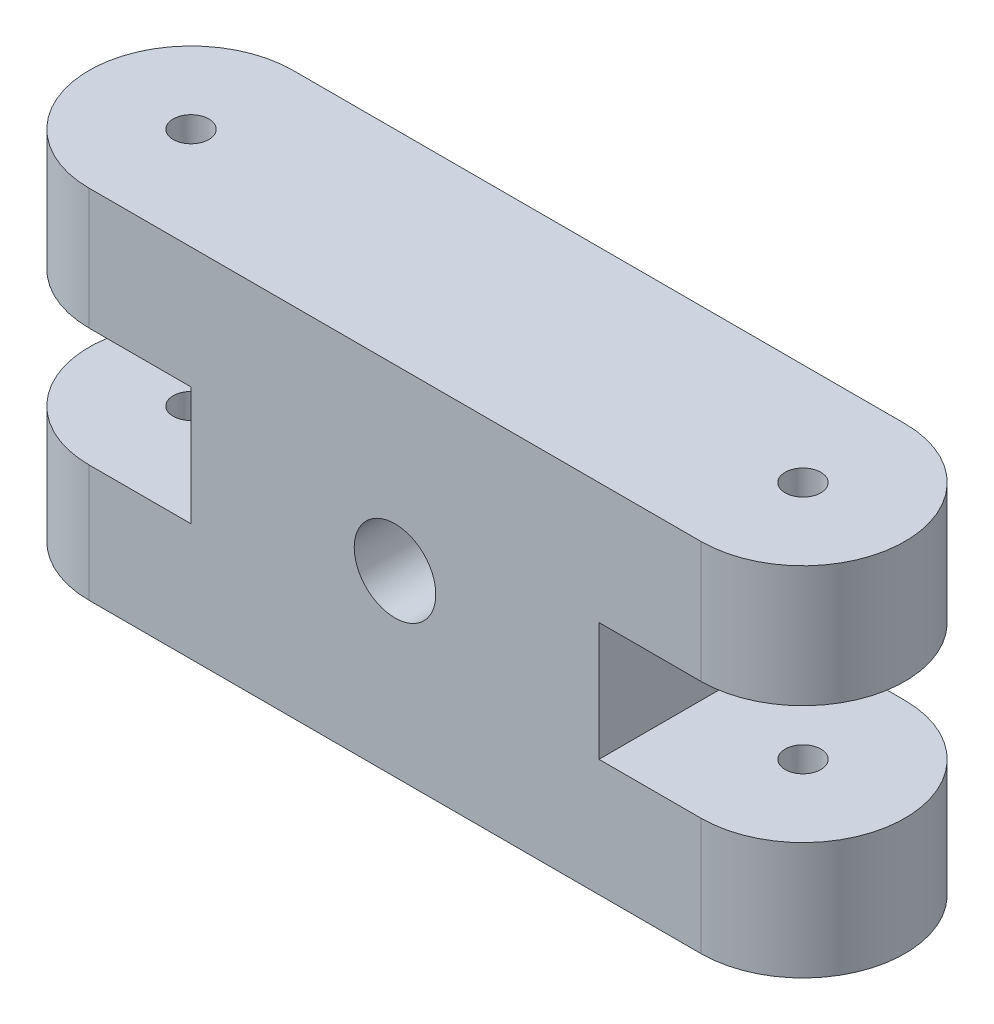
ISO-10303-21;
HEADER;
FILE_DESCRIPTION(('STEP AP214'),'2;1');
FILE_NAME('part.step','',(''),(''),'','','');
FILE_SCHEMA(('AUTOMOTIVE_DESIGN { 1 0 10303 214 1 1 1 1 }'));
ENDSEC;
DATA;
#1=APPLICATION_CONTEXT('core data for automotive mechanical design processes');
#2=APPLICATION_PROTOCOL_DEFINITION('international standard','automotive_design',2000,#1);
#3=PRODUCT_CONTEXT('',#1,'mechanical');
#4=PRODUCT('Part','Part','',(#3));
#5=PRODUCT_RELATED_PRODUCT_CATEGORY('part','',(#4));
#6=PRODUCT_DEFINITION_FORMATION('','',#4);
#7=PRODUCT_DEFINITION_CONTEXT('part definition',#1,'design');
#8=PRODUCT_DEFINITION('design','',#6,#7);
#9=PRODUCT_DEFINITION_SHAPE('','',#8);
#10=(LENGTH_UNIT() NAMED_UNIT(*) SI_UNIT(.MILLI.,.METRE.));
#11=(NAMED_UNIT(*) PLANE_ANGLE_UNIT() SI_UNIT($,.RADIAN.));
#12=(NAMED_UNIT(*) SI_UNIT($,.STERADIAN.) SOLID_ANGLE_UNIT());
#13=UNCERTAINTY_MEASURE_WITH_UNIT(LENGTH_MEASURE(1.E-05),#10,'distance_accuracy_value','');
#14=(GEOMETRIC_REPRESENTATION_CONTEXT(3) GLOBAL_UNCERTAINTY_ASSIGNED_CONTEXT((#13)) GLOBAL_UNIT_ASSIGNED_CONTEXT((#10,
#11,#12)) REPRESENTATION_CONTEXT('',''));
#15=CARTESIAN_POINT('',(0.,0.,0.));
#16=DIRECTION('',(0.,0.,1.));
#17=DIRECTION('',(1.,0.,0.));
#18=AXIS2_PLACEMENT_3D('',#15,#16,#17);
#19=CARTESIAN_POINT('',(30.,35.,0.));
#20=DIRECTION('',(0.,-1.,0.));
#21=DIRECTION('',(0.,0.,-1.));
#22=AXIS2_PLACEMENT_3D('',#19,#20,#21);
#23=CYLINDRICAL_SURFACE('',#22,10.);
#24=DIRECTION('',(0.,-1.,0.));
#25=VECTOR('',#24,1.);
#26=CARTESIAN_POINT('',(30.,35.,10.));
#27=LINE('',#26,#25);
#28=CARTESIAN_POINT('',(30.,35.,10.));
#29=VERTEX_POINT('',#28);
#30=CARTESIAN_POINT('',(30.,23.1186062973854,10.));
#31=VERTEX_POINT('',#30);
#32=EDGE_CURVE('E226',#29,#31,#27,.T.);
#33=ORIENTED_EDGE('',*,*,#32,.T.);
#34=CARTESIAN_POINT('',(30.,23.1186062973854,0.));
#35=DIRECTION('',(0.,1.,0.));
#36=DIRECTION('',(0.,0.,1.));
#37=AXIS2_PLACEMENT_3D('',#34,#35,#36);
#38=CIRCLE('',#37,10.);
#39=CARTESIAN_POINT('',(30.,23.1186062973854,-10.));
#40=VERTEX_POINT('',#39);
#41=EDGE_CURVE('E184',#31,#40,#38,.T.);
#42=ORIENTED_EDGE('',*,*,#41,.T.);
#43=DIRECTION('',(0.,-1.,0.));
#44=VECTOR('',#43,1.);
#45=CARTESIAN_POINT('',(30.,35.,-10.));
#46=LINE('',#45,#44);
#47=CARTESIAN_POINT('',(30.,35.,-10.));
#48=VERTEX_POINT('',#47);
#49=EDGE_CURVE('E11',#48,#40,#46,.T.);
#50=ORIENTED_EDGE('',*,*,#49,.F.);
#51=CARTESIAN_POINT('',(30.,35.,0.));
#52=DIRECTION('',(0.,1.,0.));
#53=DIRECTION('',(0.,0.,1.));
#54=AXIS2_PLACEMENT_3D('',#51,#52,#53);
#55=CIRCLE('',#54,10.);
#56=EDGE_CURVE('E196',#29,#48,#55,.T.);
#57=ORIENTED_EDGE('',*,*,#56,.F.);
#58=EDGE_LOOP('',(#33,#42,#50,#57));
#59=FACE_BOUND('',#58,.T.);
#60=ADVANCED_FACE('F32',(#59),#23,.T.);
#61=CARTESIAN_POINT('',(0.,35.,-10.));
#62=DIRECTION('',(0.,0.,-1.));
#63=DIRECTION('',(-1.,0.,0.));
#64=AXIS2_PLACEMENT_3D('',#61,#62,#63);
#65=PLANE('',#64);
#66=DIRECTION('',(1.,0.,0.));
#67=VECTOR('',#66,1.);
#68=CARTESIAN_POINT('',(0.,23.1186062973854,-10.));
#69=LINE('',#68,#67);
#70=CARTESIAN_POINT('',(20.,23.1186062973854,-10.));
#71=VERTEX_POINT('',#70);
#72=EDGE_CURVE('E166',#71,#40,#69,.T.);
#73=ORIENTED_EDGE('',*,*,#72,.F.);
#74=DIRECTION('',(0.,1.,0.));
#75=VECTOR('',#74,1.);
#76=CARTESIAN_POINT('',(20.,0.,-10.));
#77=LINE('',#76,#75);
#78=CARTESIAN_POINT('',(20.,11.5,-10.));
#79=VERTEX_POINT('',#78);
#80=EDGE_CURVE('E161',#79,#71,#77,.T.);
#81=ORIENTED_EDGE('',*,*,#80,.F.);
#82=DIRECTION('',(-1.,0.,0.));
#83=VECTOR('',#82,1.);
#84=CARTESIAN_POINT('',(0.,11.5,-10.));
#85=LINE('',#84,#83);
#86=CARTESIAN_POINT('',(30.,11.5,-10.));
#87=VERTEX_POINT('',#86);
#88=EDGE_CURVE('E168',#87,#79,#85,.T.);
#89=ORIENTED_EDGE('',*,*,#88,.F.);
#90=CARTESIAN_POINT('',(30.,0.,-10.));
#91=VERTEX_POINT('',#90);
#92=EDGE_CURVE('E41',#87,#91,#46,.T.);
#93=ORIENTED_EDGE('',*,*,#92,.T.);
#94=DIRECTION('',(1.,0.,0.));
#95=VECTOR('',#94,1.);
#96=CARTESIAN_POINT('',(0.,0.,-10.));
#97=LINE('',#96,#95);
#98=CARTESIAN_POINT('',(-30.,0.,-10.));
#99=VERTEX_POINT('',#98);
#100=EDGE_CURVE('E215',#99,#91,#97,.T.);
#101=ORIENTED_EDGE('',*,*,#100,.F.);
#102=DIRECTION('',(0.,-1.,0.));
#103=VECTOR('',#102,1.);
#104=CARTESIAN_POINT('',(-30.,35.,-10.));
#105=LINE('',#104,#103);
#106=CARTESIAN_POINT('',(-30.,11.5,-10.));
#107=VERTEX_POINT('',#106);
#108=EDGE_CURVE('E231',#107,#99,#105,.T.);
#109=ORIENTED_EDGE('',*,*,#108,.F.);
#110=DIRECTION('',(1.,0.,0.));
#111=VECTOR('',#110,1.);
#112=CARTESIAN_POINT('',(0.,11.5,-10.));
#113=LINE('',#112,#111);
#114=CARTESIAN_POINT('',(-20.,11.5,-10.));
#115=VERTEX_POINT('',#114);
#116=EDGE_CURVE('E145',#107,#115,#113,.T.);
#117=ORIENTED_EDGE('',*,*,#116,.T.);
#118=DIRECTION('',(0.,1.,0.));
#119=VECTOR('',#118,1.);
#120=CARTESIAN_POINT('',(-20.,0.,-10.));
#121=LINE('',#120,#119);
#122=CARTESIAN_POINT('',(-20.,23.1186062973854,-10.));
#123=VERTEX_POINT('',#122);
#124=EDGE_CURVE('E148',#115,#123,#121,.T.);
#125=ORIENTED_EDGE('',*,*,#124,.T.);
#126=DIRECTION('',(-1.,0.,0.));
#127=VECTOR('',#126,1.);
#128=CARTESIAN_POINT('',(0.,23.1186062973854,-10.));
#129=LINE('',#128,#127);
#130=CARTESIAN_POINT('',(-30.,23.1186062973854,-10.));
#131=VERTEX_POINT('',#130);
#132=EDGE_CURVE('E137',#123,#131,#129,.T.);
#133=ORIENTED_EDGE('',*,*,#132,.T.);
#134=CARTESIAN_POINT('',(-30.,35.,-10.));
#135=VERTEX_POINT('',#134);
#136=EDGE_CURVE('E232',#135,#131,#105,.T.);
#137=ORIENTED_EDGE('',*,*,#136,.F.);
#138=DIRECTION('',(1.,0.,0.));
#139=VECTOR('',#138,1.);
#140=CARTESIAN_POINT('',(0.,35.,-10.));
#141=LINE('',#140,#139);
#142=EDGE_CURVE('E199',#135,#48,#141,.T.);
#143=ORIENTED_EDGE('',*,*,#142,.T.);
#144=ORIENTED_EDGE('',*,*,#49,.T.);
#145=EDGE_LOOP('',(#73,#81,#89,#93,#101,#109,#117,#125,#133,#137,#143,#144));
#146=FACE_BOUND('',#145,.T.);
#147=CARTESIAN_POINT('',(0.,17.5,-10.));
#148=DIRECTION('',(0.,0.,-1.));
#149=DIRECTION('',(-1.,0.,0.));
#150=AXIS2_PLACEMENT_3D('',#147,#148,#149);
#151=CIRCLE('',#150,4.);
#152=CARTESIAN_POINT('',(-4.,17.5,-10.));
#153=VERTEX_POINT('',#152);
#154=EDGE_CURVE('E155',#153,#153,#151,.T.);
#155=ORIENTED_EDGE('',*,*,#154,.F.);
#156=EDGE_LOOP('',(#155));
#157=FACE_BOUND('',#156,.T.);
#158=ADVANCED_FACE('F269',(#146,#157),#65,.T.);
#159=CARTESIAN_POINT('',(-30.,35.,0.));
#160=DIRECTION('',(0.,-1.,0.));
#161=DIRECTION('',(0.,0.,-1.));
#162=AXIS2_PLACEMENT_3D('',#159,#160,#161);
#163=CYLINDRICAL_SURFACE('',#162,10.);
#164=CARTESIAN_POINT('',(-30.,23.1186062973854,0.));
#165=DIRECTION('',(0.,-1.,0.));
#166=DIRECTION('',(0.,0.,-1.));
#167=AXIS2_PLACEMENT_3D('',#164,#165,#166);
#168=CIRCLE('',#167,10.);
#169=CARTESIAN_POINT('',(-30.,23.1186062973854,10.));
#170=VERTEX_POINT('',#169);
#171=EDGE_CURVE('E190',#170,#131,#168,.T.);
#172=ORIENTED_EDGE('',*,*,#171,.F.);
#173=DIRECTION('',(0.,-1.,0.));
#174=VECTOR('',#173,1.);
#175=CARTESIAN_POINT('',(-30.,35.,10.));
#176=LINE('',#175,#174);
#177=CARTESIAN_POINT('',(-30.,35.,10.));
#178=VERTEX_POINT('',#177);
#179=EDGE_CURVE('E144',#178,#170,#176,.T.);
#180=ORIENTED_EDGE('',*,*,#179,.F.);
#181=CARTESIAN_POINT('',(-30.,35.,0.));
#182=DIRECTION('',(0.,1.,0.));
#183=DIRECTION('',(0.,0.,1.));
#184=AXIS2_PLACEMENT_3D('',#181,#182,#183);
#185=CIRCLE('',#184,10.);
#186=EDGE_CURVE('E202',#135,#178,#185,.T.);
#187=ORIENTED_EDGE('',*,*,#186,.F.);
#188=ORIENTED_EDGE('',*,*,#136,.T.);
#189=EDGE_LOOP('',(#172,#180,#187,#188));
#190=FACE_BOUND('',#189,.T.);
#191=ADVANCED_FACE('F285',(#190),#163,.T.);
#192=CARTESIAN_POINT('',(-30.,11.5,0.));
#193=DIRECTION('',(0.,1.,0.));
#194=DIRECTION('',(-1.,0.,0.));
#195=AXIS2_PLACEMENT_3D('',#192,#193,#194);
#196=CIRCLE('',#195,10.);
#197=CARTESIAN_POINT('',(-30.,11.5,10.));
#198=VERTEX_POINT('',#197);
#199=EDGE_CURVE('E188',#107,#198,#196,.T.);
#200=ORIENTED_EDGE('',*,*,#199,.F.);
#201=ORIENTED_EDGE('',*,*,#108,.T.);
#202=CARTESIAN_POINT('',(-30.,0.,0.));
#203=DIRECTION('',(0.,1.,0.));
#204=DIRECTION('',(0.,0.,1.));
#205=AXIS2_PLACEMENT_3D('',#202,#203,#204);
#206=CIRCLE('',#205,10.);
#207=CARTESIAN_POINT('',(-30.,0.,10.));
#208=VERTEX_POINT('',#207);
#209=EDGE_CURVE('E218',#99,#208,#206,.T.);
#210=ORIENTED_EDGE('',*,*,#209,.T.);
#211=EDGE_CURVE('E229',#198,#208,#176,.T.);
#212=ORIENTED_EDGE('',*,*,#211,.F.);
#213=EDGE_LOOP('',(#200,#201,#210,#212));
#214=FACE_BOUND('',#213,.T.);
#215=ADVANCED_FACE('F251',(#214),#163,.T.);
#216=CARTESIAN_POINT('',(0.,35.,10.));
#217=DIRECTION('',(0.,0.,-1.));
#218=DIRECTION('',(-1.,0.,0.));
#219=AXIS2_PLACEMENT_3D('',#216,#217,#218);
#220=PLANE('',#219);
#221=CARTESIAN_POINT('',(0.,17.5,10.));
#222=DIRECTION('',(0.,0.,-1.));
#223=DIRECTION('',(-1.,0.,0.));
#224=AXIS2_PLACEMENT_3D('',#221,#222,#223);
#225=CIRCLE('',#224,4.);
#226=CARTESIAN_POINT('',(-4.,17.5,10.));
#227=VERTEX_POINT('',#226);
#228=EDGE_CURVE('E174',#227,#227,#225,.T.);
#229=ORIENTED_EDGE('',*,*,#228,.T.);
#230=EDGE_LOOP('',(#229));
#231=FACE_BOUND('',#230,.T.);
#232=DIRECTION('',(0.,1.,0.));
#233=VECTOR('',#232,1.);
#234=CARTESIAN_POINT('',(20.,0.,10.));
#235=LINE('',#234,#233);
#236=CARTESIAN_POINT('',(20.,11.5,10.));
#237=VERTEX_POINT('',#236);
#238=CARTESIAN_POINT('',(20.,23.1186062973854,10.));
#239=VERTEX_POINT('',#238);
#240=EDGE_CURVE('E49',#237,#239,#235,.T.);
#241=ORIENTED_EDGE('',*,*,#240,.T.);
#242=DIRECTION('',(1.,0.,0.));
#243=VECTOR('',#242,1.);
#244=CARTESIAN_POINT('',(0.,23.1186062973854,10.));
#245=LINE('',#244,#243);
#246=EDGE_CURVE('E157',#239,#31,#245,.T.);
#247=ORIENTED_EDGE('',*,*,#246,.T.);
#248=ORIENTED_EDGE('',*,*,#32,.F.);
#249=DIRECTION('',(1.,0.,0.));
#250=VECTOR('',#249,1.);
#251=CARTESIAN_POINT('',(0.,35.,10.));
#252=LINE('',#251,#250);
#253=EDGE_CURVE('E204',#178,#29,#252,.T.);
#254=ORIENTED_EDGE('',*,*,#253,.F.);
#255=ORIENTED_EDGE('',*,*,#179,.T.);
#256=DIRECTION('',(-1.,0.,0.));
#257=VECTOR('',#256,1.);
#258=CARTESIAN_POINT('',(0.,23.1186062973854,10.));
#259=LINE('',#258,#257);
#260=CARTESIAN_POINT('',(-20.,23.1186062973854,10.));
#261=VERTEX_POINT('',#260);
#262=EDGE_CURVE('E131',#261,#170,#259,.T.);
#263=ORIENTED_EDGE('',*,*,#262,.F.);
#264=DIRECTION('',(0.,1.,0.));
#265=VECTOR('',#264,1.);
#266=CARTESIAN_POINT('',(-20.,0.,10.));
#267=LINE('',#266,#265);
#268=CARTESIAN_POINT('',(-20.,11.5,10.));
#269=VERTEX_POINT('',#268);
#270=EDGE_CURVE('E122',#269,#261,#267,.T.);
#271=ORIENTED_EDGE('',*,*,#270,.F.);
#272=DIRECTION('',(1.,0.,0.));
#273=VECTOR('',#272,1.);
#274=CARTESIAN_POINT('',(0.,11.5,10.));
#275=LINE('',#274,#273);
#276=EDGE_CURVE('E130',#198,#269,#275,.T.);
#277=ORIENTED_EDGE('',*,*,#276,.F.);
#278=ORIENTED_EDGE('',*,*,#211,.T.);
#279=DIRECTION('',(1.,0.,0.));
#280=VECTOR('',#279,1.);
#281=CARTESIAN_POINT('',(0.,0.,10.));
#282=LINE('',#281,#280);
#283=CARTESIAN_POINT('',(30.,0.,10.));
#284=VERTEX_POINT('',#283);
#285=EDGE_CURVE('E221',#208,#284,#282,.T.);
#286=ORIENTED_EDGE('',*,*,#285,.T.);
#287=CARTESIAN_POINT('',(30.,11.5,10.));
#288=VERTEX_POINT('',#287);
#289=EDGE_CURVE('E209',#288,#284,#27,.T.);
#290=ORIENTED_EDGE('',*,*,#289,.F.);
#291=DIRECTION('',(-1.,0.,0.));
#292=VECTOR('',#291,1.);
#293=CARTESIAN_POINT('',(0.,11.5,10.));
#294=LINE('',#293,#292);
#295=EDGE_CURVE('E160',#288,#237,#294,.T.);
#296=ORIENTED_EDGE('',*,*,#295,.T.);
#297=EDGE_LOOP('',(#241,#247,#248,#254,#255,#263,#271,#277,#278,#286,#290,#296));
#298=FACE_BOUND('',#297,.T.);
#299=ADVANCED_FACE('F141',(#231,#298),#220,.F.);
#300=CARTESIAN_POINT('',(-30.,35.,0.));
#301=DIRECTION('',(0.,-1.,0.));
#302=DIRECTION('',(0.,0.,-1.));
#303=AXIS2_PLACEMENT_3D('',#300,#301,#302);
#304=CYLINDRICAL_SURFACE('',#303,1.75);
#305=CARTESIAN_POINT('',(-30.,35.,0.));
#306=DIRECTION('',(0.,1.,0.));
#307=DIRECTION('',(0.,0.,1.));
#308=AXIS2_PLACEMENT_3D('',#305,#306,#307);
#309=CIRCLE('',#308,1.75);
#310=CARTESIAN_POINT('',(-30.,35.,1.75));
#311=VERTEX_POINT('',#310);
#312=EDGE_CURVE('E193',#311,#311,#309,.T.);
#313=ORIENTED_EDGE('',*,*,#312,.T.);
#314=EDGE_LOOP('',(#313));
#315=FACE_BOUND('',#314,.T.);
#316=CARTESIAN_POINT('',(-30.,23.1186062973854,0.));
#317=DIRECTION('',(0.,-1.,0.));
#318=DIRECTION('',(0.,0.,-1.));
#319=AXIS2_PLACEMENT_3D('',#316,#317,#318);
#320=CIRCLE('',#319,1.75);
#321=CARTESIAN_POINT('',(-30.,23.1186062973854,-1.75));
#322=VERTEX_POINT('',#321);
#323=EDGE_CURVE('E36',#322,#322,#320,.T.);
#324=ORIENTED_EDGE('',*,*,#323,.T.);
#325=EDGE_LOOP('',(#324));
#326=FACE_BOUND('',#325,.T.);
#327=ADVANCED_FACE('F34',(#315,#326),#304,.F.);
#328=CARTESIAN_POINT('',(-30.,0.,0.));
#329=DIRECTION('',(0.,1.,0.));
#330=DIRECTION('',(0.,0.,1.));
#331=AXIS2_PLACEMENT_3D('',#328,#329,#330);
#332=CIRCLE('',#331,1.75);
#333=CARTESIAN_POINT('',(-30.,0.,1.75));
#334=VERTEX_POINT('',#333);
#335=EDGE_CURVE('E192',#334,#334,#332,.T.);
#336=ORIENTED_EDGE('',*,*,#335,.F.);
#337=EDGE_LOOP('',(#336));
#338=FACE_BOUND('',#337,.T.);
#339=CARTESIAN_POINT('',(-30.,11.5,0.));
#340=DIRECTION('',(0.,1.,0.));
#341=DIRECTION('',(-1.,0.,0.));
#342=AXIS2_PLACEMENT_3D('',#339,#340,#341);
#343=CIRCLE('',#342,1.75);
#344=CARTESIAN_POINT('',(-31.75,11.5,0.));
#345=VERTEX_POINT('',#344);
#346=EDGE_CURVE('E187',#345,#345,#343,.T.);
#347=ORIENTED_EDGE('',*,*,#346,.T.);
#348=EDGE_LOOP('',(#347));
#349=FACE_BOUND('',#348,.T.);
#350=ADVANCED_FACE('F241',(#338,#349),#304,.F.);
#351=CARTESIAN_POINT('',(30.,35.,0.));
#352=DIRECTION('',(0.,-1.,0.));
#353=DIRECTION('',(0.,0.,-1.));
#354=AXIS2_PLACEMENT_3D('',#351,#352,#353);
#355=CYLINDRICAL_SURFACE('',#354,1.75);
#356=CARTESIAN_POINT('',(30.,23.1186062973854,0.));
#357=DIRECTION('',(0.,1.,0.));
#358=DIRECTION('',(0.,0.,1.));
#359=AXIS2_PLACEMENT_3D('',#356,#357,#358);
#360=CIRCLE('',#359,1.75);
#361=CARTESIAN_POINT('',(30.,23.1186062973854,1.75000000000001));
#362=VERTEX_POINT('',#361);
#363=EDGE_CURVE('E183',#362,#362,#360,.T.);
#364=ORIENTED_EDGE('',*,*,#363,.F.);
#365=EDGE_LOOP('',(#364));
#366=FACE_BOUND('',#365,.T.);
#367=CARTESIAN_POINT('',(30.,35.,0.));
#368=DIRECTION('',(0.,1.,0.));
#369=DIRECTION('',(0.,0.,1.));
#370=AXIS2_PLACEMENT_3D('',#367,#368,#369);
#371=CIRCLE('',#370,1.75);
#372=CARTESIAN_POINT('',(30.,35.,1.75000000000001));
#373=VERTEX_POINT('',#372);
#374=EDGE_CURVE('E206',#373,#373,#371,.T.);
#375=ORIENTED_EDGE('',*,*,#374,.T.);
#376=EDGE_LOOP('',(#375));
#377=FACE_BOUND('',#376,.T.);
#378=ADVANCED_FACE('F299',(#366,#377),#355,.F.);
#379=ORIENTED_EDGE('',*,*,#92,.F.);
#380=CARTESIAN_POINT('',(30.,11.5,0.));
#381=DIRECTION('',(0.,-1.,0.));
#382=DIRECTION('',(1.,0.,0.));
#383=AXIS2_PLACEMENT_3D('',#380,#381,#382);
#384=CIRCLE('',#383,10.);
#385=EDGE_CURVE('E180',#87,#288,#384,.T.);
#386=ORIENTED_EDGE('',*,*,#385,.T.);
#387=ORIENTED_EDGE('',*,*,#289,.T.);
#388=CARTESIAN_POINT('',(30.,0.,0.));
#389=DIRECTION('',(0.,1.,0.));
#390=DIRECTION('',(0.,0.,1.));
#391=AXIS2_PLACEMENT_3D('',#388,#389,#390);
#392=CIRCLE('',#391,10.);
#393=EDGE_CURVE('E212',#284,#91,#392,.T.);
#394=ORIENTED_EDGE('',*,*,#393,.T.);
#395=EDGE_LOOP('',(#379,#386,#387,#394));
#396=FACE_BOUND('',#395,.T.);
#397=ADVANCED_FACE('F262',(#396),#23,.T.);
#398=CARTESIAN_POINT('',(30.,11.5,0.));
#399=DIRECTION('',(0.,-1.,0.));
#400=DIRECTION('',(1.,0.,0.));
#401=AXIS2_PLACEMENT_3D('',#398,#399,#400);
#402=CIRCLE('',#401,1.75);
#403=CARTESIAN_POINT('',(31.75,11.5,0.));
#404=VERTEX_POINT('',#403);
#405=EDGE_CURVE('E177',#404,#404,#402,.T.);
#406=ORIENTED_EDGE('',*,*,#405,.F.);
#407=EDGE_LOOP('',(#406));
#408=FACE_BOUND('',#407,.T.);
#409=CARTESIAN_POINT('',(30.,0.,0.));
#410=DIRECTION('',(0.,1.,0.));
#411=DIRECTION('',(0.,0.,1.));
#412=AXIS2_PLACEMENT_3D('',#409,#410,#411);
#413=CIRCLE('',#412,1.75);
#414=CARTESIAN_POINT('',(30.,0.,1.75000000000001));
#415=VERTEX_POINT('',#414);
#416=EDGE_CURVE('E197',#415,#415,#413,.T.);
#417=ORIENTED_EDGE('',*,*,#416,.F.);
#418=EDGE_LOOP('',(#417));
#419=FACE_BOUND('',#418,.T.);
#420=ADVANCED_FACE('F298',(#408,#419),#355,.F.);
#421=CARTESIAN_POINT('',(0.,35.,0.));
#422=DIRECTION('',(0.,1.,0.));
#423=DIRECTION('',(0.,0.,1.));
#424=AXIS2_PLACEMENT_3D('',#421,#422,#423);
#425=PLANE('',#424);
#426=ORIENTED_EDGE('',*,*,#312,.F.);
#427=EDGE_LOOP('',(#426));
#428=FACE_BOUND('',#427,.T.);
#429=ORIENTED_EDGE('',*,*,#56,.T.);
#430=ORIENTED_EDGE('',*,*,#142,.F.);
#431=ORIENTED_EDGE('',*,*,#186,.T.);
#432=ORIENTED_EDGE('',*,*,#253,.T.);
#433=EDGE_LOOP('',(#429,#430,#431,#432));
#434=FACE_BOUND('',#433,.T.);
#435=ORIENTED_EDGE('',*,*,#374,.F.);
#436=EDGE_LOOP('',(#435));
#437=FACE_BOUND('',#436,.T.);
#438=ADVANCED_FACE('F281',(#428,#434,#437),#425,.T.);
#439=CARTESIAN_POINT('',(0.,0.,0.));
#440=DIRECTION('',(0.,1.,0.));
#441=DIRECTION('',(0.,0.,1.));
#442=AXIS2_PLACEMENT_3D('',#439,#440,#441);
#443=PLANE('',#442);
#444=ORIENTED_EDGE('',*,*,#335,.T.);
#445=EDGE_LOOP('',(#444));
#446=FACE_BOUND('',#445,.T.);
#447=ORIENTED_EDGE('',*,*,#393,.F.);
#448=ORIENTED_EDGE('',*,*,#285,.F.);
#449=ORIENTED_EDGE('',*,*,#209,.F.);
#450=ORIENTED_EDGE('',*,*,#100,.T.);
#451=EDGE_LOOP('',(#447,#448,#449,#450));
#452=FACE_BOUND('',#451,.T.);
#453=ORIENTED_EDGE('',*,*,#416,.T.);
#454=EDGE_LOOP('',(#453));
#455=FACE_BOUND('',#454,.T.);
#456=ADVANCED_FACE('F257',(#446,#452,#455),#443,.F.);
#457=CARTESIAN_POINT('',(0.,23.1186062973854,10.));
#458=DIRECTION('',(0.,1.,0.));
#459=DIRECTION('',(0.,0.,1.));
#460=AXIS2_PLACEMENT_3D('',#457,#458,#459);
#461=PLANE('',#460);
#462=ORIENTED_EDGE('',*,*,#363,.T.);
#463=EDGE_LOOP('',(#462));
#464=FACE_BOUND('',#463,.T.);
#465=ORIENTED_EDGE('',*,*,#246,.F.);
#466=DIRECTION('',(0.,0.,-1.));
#467=VECTOR('',#466,1.);
#468=CARTESIAN_POINT('',(20.,23.1186062973854,10.));
#469=LINE('',#468,#467);
#470=EDGE_CURVE('E153',#239,#71,#469,.T.);
#471=ORIENTED_EDGE('',*,*,#470,.T.);
#472=ORIENTED_EDGE('',*,*,#72,.T.);
#473=ORIENTED_EDGE('',*,*,#41,.F.);
#474=EDGE_LOOP('',(#465,#471,#472,#473));
#475=FACE_BOUND('',#474,.T.);
#476=ADVANCED_FACE('F274',(#464,#475),#461,.F.);
#477=CARTESIAN_POINT('',(0.,11.5,10.));
#478=DIRECTION('',(0.,-1.,0.));
#479=DIRECTION('',(1.,0.,0.));
#480=AXIS2_PLACEMENT_3D('',#477,#478,#479);
#481=PLANE('',#480);
#482=ORIENTED_EDGE('',*,*,#405,.T.);
#483=EDGE_LOOP('',(#482));
#484=FACE_BOUND('',#483,.T.);
#485=ORIENTED_EDGE('',*,*,#88,.T.);
#486=DIRECTION('',(0.,0.,-1.));
#487=VECTOR('',#486,1.);
#488=CARTESIAN_POINT('',(20.,11.5,10.));
#489=LINE('',#488,#487);
#490=EDGE_CURVE('E165',#237,#79,#489,.T.);
#491=ORIENTED_EDGE('',*,*,#490,.F.);
#492=ORIENTED_EDGE('',*,*,#295,.F.);
#493=ORIENTED_EDGE('',*,*,#385,.F.);
#494=EDGE_LOOP('',(#485,#491,#492,#493));
#495=FACE_BOUND('',#494,.T.);
#496=ADVANCED_FACE('F265',(#484,#495),#481,.F.);
#497=CARTESIAN_POINT('',(20.,0.,10.));
#498=DIRECTION('',(-1.,0.,0.));
#499=DIRECTION('',(0.,0.,1.));
#500=AXIS2_PLACEMENT_3D('',#497,#498,#499);
#501=PLANE('',#500);
#502=ORIENTED_EDGE('',*,*,#80,.T.);
#503=ORIENTED_EDGE('',*,*,#470,.F.);
#504=ORIENTED_EDGE('',*,*,#240,.F.);
#505=ORIENTED_EDGE('',*,*,#490,.T.);
#506=EDGE_LOOP('',(#502,#503,#504,#505));
#507=FACE_BOUND('',#506,.T.);
#508=ADVANCED_FACE('F271',(#507),#501,.F.);
#509=CARTESIAN_POINT('',(0.,23.1186062973854,10.));
#510=DIRECTION('',(0.,-1.,0.));
#511=DIRECTION('',(0.,0.,-1.));
#512=AXIS2_PLACEMENT_3D('',#509,#510,#511);
#513=PLANE('',#512);
#514=ORIENTED_EDGE('',*,*,#323,.F.);
#515=EDGE_LOOP('',(#514));
#516=FACE_BOUND('',#515,.T.);
#517=ORIENTED_EDGE('',*,*,#171,.T.);
#518=ORIENTED_EDGE('',*,*,#132,.F.);
#519=DIRECTION('',(0.,0.,-1.));
#520=VECTOR('',#519,1.);
#521=CARTESIAN_POINT('',(-20.,23.1186062973854,10.));
#522=LINE('',#521,#520);
#523=EDGE_CURVE('E125',#261,#123,#522,.T.);
#524=ORIENTED_EDGE('',*,*,#523,.F.);
#525=ORIENTED_EDGE('',*,*,#262,.T.);
#526=EDGE_LOOP('',(#517,#518,#524,#525));
#527=FACE_BOUND('',#526,.T.);
#528=ADVANCED_FACE('F134',(#516,#527),#513,.T.);
#529=CARTESIAN_POINT('',(0.,11.5,10.));
#530=DIRECTION('',(0.,1.,0.));
#531=DIRECTION('',(-1.,0.,0.));
#532=AXIS2_PLACEMENT_3D('',#529,#530,#531);
#533=PLANE('',#532);
#534=ORIENTED_EDGE('',*,*,#346,.F.);
#535=EDGE_LOOP('',(#534));
#536=FACE_BOUND('',#535,.T.);
#537=ORIENTED_EDGE('',*,*,#199,.T.);
#538=ORIENTED_EDGE('',*,*,#276,.T.);
#539=DIRECTION('',(0.,0.,-1.));
#540=VECTOR('',#539,1.);
#541=CARTESIAN_POINT('',(-20.,11.5,10.));
#542=LINE('',#541,#540);
#543=EDGE_CURVE('E57',#269,#115,#542,.T.);
#544=ORIENTED_EDGE('',*,*,#543,.T.);
#545=ORIENTED_EDGE('',*,*,#116,.F.);
#546=EDGE_LOOP('',(#537,#538,#544,#545));
#547=FACE_BOUND('',#546,.T.);
#548=ADVANCED_FACE('F243',(#536,#547),#533,.T.);
#549=CARTESIAN_POINT('',(-20.,0.,10.));
#550=DIRECTION('',(-1.,0.,0.));
#551=DIRECTION('',(0.,0.,1.));
#552=AXIS2_PLACEMENT_3D('',#549,#550,#551);
#553=PLANE('',#552);
#554=ORIENTED_EDGE('',*,*,#124,.F.);
#555=ORIENTED_EDGE('',*,*,#543,.F.);
#556=ORIENTED_EDGE('',*,*,#270,.T.);
#557=ORIENTED_EDGE('',*,*,#523,.T.);
#558=EDGE_LOOP('',(#554,#555,#556,#557));
#559=FACE_BOUND('',#558,.T.);
#560=ADVANCED_FACE('F124',(#559),#553,.T.);
#561=CARTESIAN_POINT('',(0.,17.5,10.));
#562=DIRECTION('',(0.,0.,-1.));
#563=DIRECTION('',(-1.,0.,0.));
#564=AXIS2_PLACEMENT_3D('',#561,#562,#563);
#565=CYLINDRICAL_SURFACE('',#564,4.);
#566=ORIENTED_EDGE('',*,*,#228,.F.);
#567=EDGE_LOOP('',(#566));
#568=FACE_BOUND('',#567,.T.);
#569=ORIENTED_EDGE('',*,*,#154,.T.);
#570=EDGE_LOOP('',(#569));
#571=FACE_BOUND('',#570,.T.);
#572=ADVANCED_FACE('F323',(#568,#571),#565,.F.);
#573=CLOSED_SHELL('',(#60,#158,#191,#215,#299,#327,#350,#378,#397,#420,#438,#456,#476,#496,#508,
#528,#548,#560,#572));
#574=MANIFOLD_SOLID_BREP('B2',#573);
#575=ADVANCED_BREP_SHAPE_REPRESENTATION('',(#18,#574),#14);
#576=SHAPE_DEFINITION_REPRESENTATION(#9,#575);
ENDSEC;
END-ISO-10303-21;
